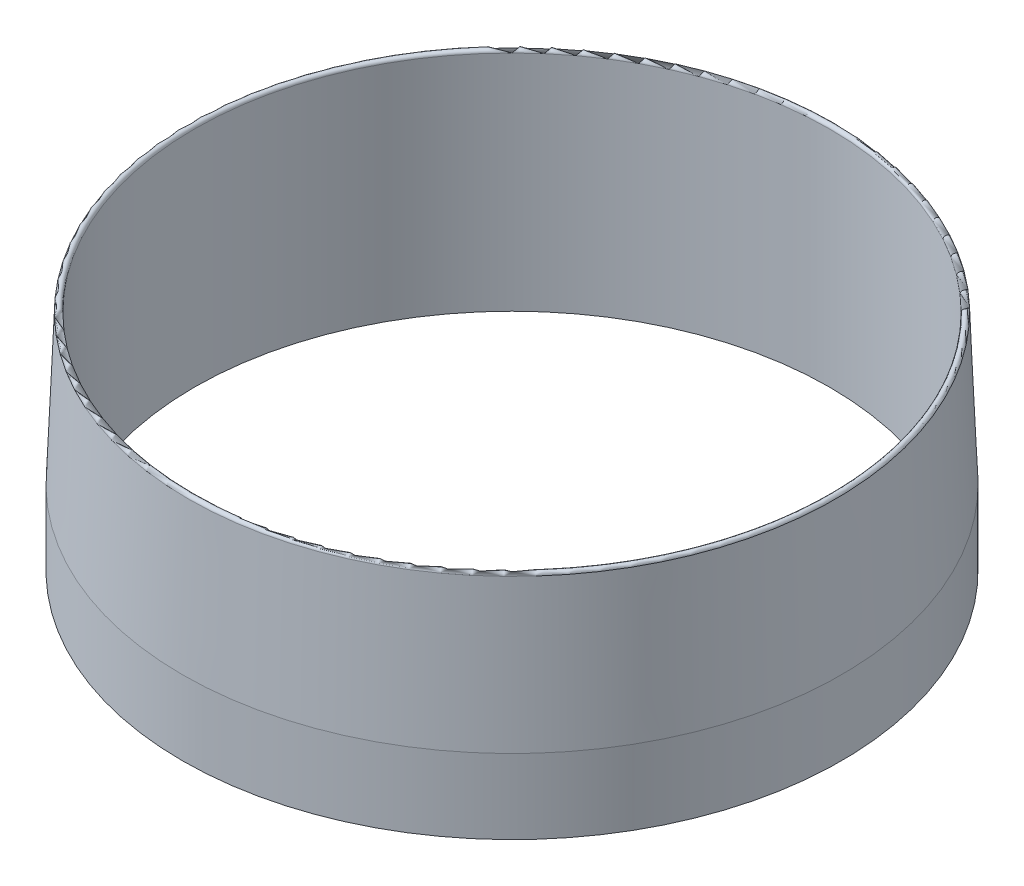
ISO-10303-21;
HEADER;
FILE_DESCRIPTION(('STEP AP214'),'2;1');
FILE_NAME('part.step','',(''),(''),'','','');
FILE_SCHEMA(('AUTOMOTIVE_DESIGN { 1 0 10303 214 1 1 1 1 }'));
ENDSEC;
DATA;
#1=APPLICATION_CONTEXT('core data for automotive mechanical design processes');
#2=APPLICATION_PROTOCOL_DEFINITION('international standard','automotive_design',2000,#1);
#3=PRODUCT_CONTEXT('',#1,'mechanical');
#4=PRODUCT('Part','Part','',(#3));
#5=PRODUCT_RELATED_PRODUCT_CATEGORY('part','',(#4));
#6=PRODUCT_DEFINITION_FORMATION('','',#4);
#7=PRODUCT_DEFINITION_CONTEXT('part definition',#1,'design');
#8=PRODUCT_DEFINITION('design','',#6,#7);
#9=PRODUCT_DEFINITION_SHAPE('','',#8);
#10=(LENGTH_UNIT() NAMED_UNIT(*) SI_UNIT(.MILLI.,.METRE.));
#11=(NAMED_UNIT(*) PLANE_ANGLE_UNIT() SI_UNIT($,.RADIAN.));
#12=(NAMED_UNIT(*) SI_UNIT($,.STERADIAN.) SOLID_ANGLE_UNIT());
#13=UNCERTAINTY_MEASURE_WITH_UNIT(LENGTH_MEASURE(1.E-05),#10,'distance_accuracy_value','');
#14=(GEOMETRIC_REPRESENTATION_CONTEXT(3) GLOBAL_UNCERTAINTY_ASSIGNED_CONTEXT((#13)) GLOBAL_UNIT_ASSIGNED_CONTEXT((#10,
#11,#12)) REPRESENTATION_CONTEXT('',''));
#15=CARTESIAN_POINT('',(0.,0.,0.));
#16=DIRECTION('',(0.,0.,1.));
#17=DIRECTION('',(1.,0.,0.));
#18=AXIS2_PLACEMENT_3D('',#15,#16,#17);
#19=CARTESIAN_POINT('',(0.,-0.9525,0.));
#20=DIRECTION('',(0.,-1.,0.));
#21=DIRECTION('',(0.,0.,-1.));
#22=AXIS2_PLACEMENT_3D('',#19,#20,#21);
#23=CYLINDRICAL_SURFACE('',#22,27.051);
#24=CARTESIAN_POINT('',(0.,19.044922030376,0.));
#25=DIRECTION('',(0.,1.,0.));
#26=DIRECTION('',(0.,0.,1.));
#27=AXIS2_PLACEMENT_3D('',#24,#25,#26);
#28=CIRCLE('',#27,27.051);
#29=CARTESIAN_POINT('',(0.,19.044922030376,27.051));
#30=VERTEX_POINT('',#29);
#31=EDGE_CURVE('E10',#30,#30,#28,.T.);
#32=ORIENTED_EDGE('',*,*,#31,.T.);
#33=EDGE_LOOP('',(#32));
#34=FACE_BOUND('',#33,.T.);
#35=CARTESIAN_POINT('',(0.,0.,0.));
#36=DIRECTION('',(0.,-1.,0.));
#37=DIRECTION('',(0.,0.,-1.));
#38=AXIS2_PLACEMENT_3D('',#35,#36,#37);
#39=CIRCLE('',#38,27.051);
#40=CARTESIAN_POINT('',(0.,0.,-27.051));
#41=VERTEX_POINT('',#40);
#42=EDGE_CURVE('E55',#41,#41,#39,.T.);
#43=ORIENTED_EDGE('',*,*,#42,.T.);
#44=EDGE_LOOP('',(#43));
#45=FACE_BOUND('',#44,.T.);
#46=ADVANCED_FACE('F41',(#34,#45),#23,.F.);
#47=CARTESIAN_POINT('',(27.051,0.,0.));
#48=DIRECTION('',(0.,-1.,0.));
#49=DIRECTION('',(0.,0.,-1.));
#50=AXIS2_PLACEMENT_3D('',#47,#48,#49);
#51=PLANE('',#50);
#52=CARTESIAN_POINT('',(0.,0.,0.));
#53=DIRECTION('',(0.,-1.,0.));
#54=DIRECTION('',(0.,0.,-1.));
#55=AXIS2_PLACEMENT_3D('',#52,#53,#54);
#56=CIRCLE('',#55,28.067);
#57=CARTESIAN_POINT('',(0.,0.,-28.067));
#58=VERTEX_POINT('',#57);
#59=EDGE_CURVE('E60',#58,#58,#56,.T.);
#60=ORIENTED_EDGE('',*,*,#59,.T.);
#61=EDGE_LOOP('',(#60));
#62=FACE_BOUND('',#61,.T.);
#63=ORIENTED_EDGE('',*,*,#42,.F.);
#64=EDGE_LOOP('',(#63));
#65=FACE_BOUND('',#64,.T.);
#66=ADVANCED_FACE('F81',(#62,#65),#51,.T.);
#67=CARTESIAN_POINT('',(0.,-0.9525,0.));
#68=DIRECTION('',(0.,-1.,0.));
#69=DIRECTION('',(0.,0.,-1.));
#70=AXIS2_PLACEMENT_3D('',#67,#68,#69);
#71=CYLINDRICAL_SURFACE('',#70,28.067);
#72=CARTESIAN_POINT('',(0.,6.35,0.));
#73=DIRECTION('',(0.,-1.,0.));
#74=DIRECTION('',(0.,0.,-1.));
#75=AXIS2_PLACEMENT_3D('',#72,#73,#74);
#76=CIRCLE('',#75,28.067);
#77=CARTESIAN_POINT('',(0.,6.35,-28.067));
#78=VERTEX_POINT('',#77);
#79=EDGE_CURVE('E66',#78,#78,#76,.T.);
#80=ORIENTED_EDGE('',*,*,#79,.T.);
#81=EDGE_LOOP('',(#80));
#82=FACE_BOUND('',#81,.T.);
#83=ORIENTED_EDGE('',*,*,#59,.F.);
#84=EDGE_LOOP('',(#83));
#85=FACE_BOUND('',#84,.T.);
#86=ADVANCED_FACE('F70',(#82,#85),#71,.T.);
#87=CARTESIAN_POINT('',(0.,6.35,0.));
#88=DIRECTION('',(0.,-1.,0.));
#89=DIRECTION('',(0.,0.,-1.));
#90=AXIS2_PLACEMENT_3D('',#87,#88,#89);
#91=CONICAL_SURFACE('',#90,28.067,0.0399786871232902);
#92=CARTESIAN_POINT('',(0.,19.0550739121165,0.));
#93=DIRECTION('',(0.,1.,0.));
#94=DIRECTION('',(0.,0.,1.));
#95=AXIS2_PLACEMENT_3D('',#92,#93,#94);
#96=CIRCLE('',#95,27.5587970435153);
#97=CARTESIAN_POINT('',(0.,19.0550739121165,27.5587970435153));
#98=VERTEX_POINT('',#97);
#99=EDGE_CURVE('E49',#98,#98,#96,.F.);
#100=ORIENTED_EDGE('',*,*,#99,.T.);
#101=EDGE_LOOP('',(#100));
#102=FACE_BOUND('',#101,.T.);
#103=ORIENTED_EDGE('',*,*,#79,.F.);
#104=EDGE_LOOP('',(#103));
#105=FACE_BOUND('',#104,.T.);
#106=ADVANCED_FACE('F73',(#102,#105),#91,.T.);
#107=CARTESIAN_POINT('',(0.,19.044922030376,0.));
#108=DIRECTION('',(0.,1.,0.));
#109=DIRECTION('',(0.,0.,1.));
#110=AXIS2_PLACEMENT_3D('',#107,#108,#109);
#111=TOROIDAL_SURFACE('',#110,27.305,0.254);
#112=ORIENTED_EDGE('',*,*,#31,.F.);
#113=EDGE_LOOP('',(#112));
#114=FACE_BOUND('',#113,.T.);
#115=ORIENTED_EDGE('',*,*,#99,.F.);
#116=EDGE_LOOP('',(#115));
#117=FACE_BOUND('',#116,.T.);
#118=ADVANCED_FACE('F43',(#114,#117),#111,.T.);
#119=CLOSED_SHELL('',(#46,#66,#86,#106,#118));
#120=MANIFOLD_SOLID_BREP('B2',#119);
#121=ADVANCED_BREP_SHAPE_REPRESENTATION('',(#18,#120),#14);
#122=SHAPE_DEFINITION_REPRESENTATION(#9,#121);
ENDSEC;
END-ISO-10303-21;
